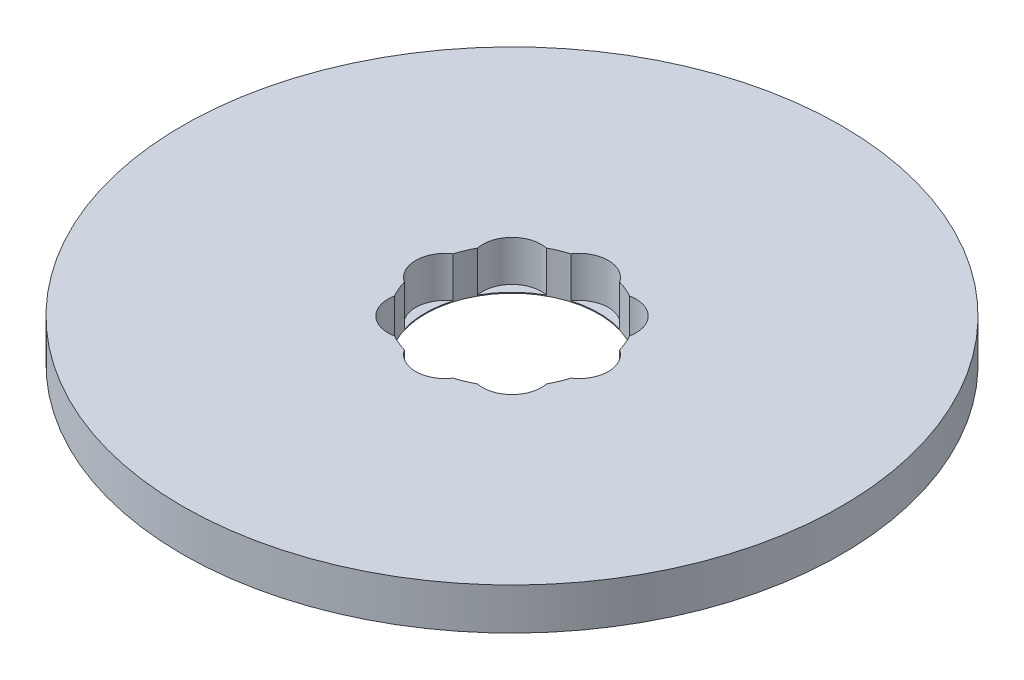
ISO-10303-21;
HEADER;
FILE_DESCRIPTION(('STEP AP214'),'2;1');
FILE_NAME('part.step','',(''),(''),'','','');
FILE_SCHEMA(('AUTOMOTIVE_DESIGN { 1 0 10303 214 1 1 1 1 }'));
ENDSEC;
DATA;
#1=APPLICATION_CONTEXT('core data for automotive mechanical design processes');
#2=APPLICATION_PROTOCOL_DEFINITION('international standard','automotive_design',2000,#1);
#3=PRODUCT_CONTEXT('',#1,'mechanical');
#4=PRODUCT('Part','Part','',(#3));
#5=PRODUCT_RELATED_PRODUCT_CATEGORY('part','',(#4));
#6=PRODUCT_DEFINITION_FORMATION('','',#4);
#7=PRODUCT_DEFINITION_CONTEXT('part definition',#1,'design');
#8=PRODUCT_DEFINITION('design','',#6,#7);
#9=PRODUCT_DEFINITION_SHAPE('','',#8);
#10=(LENGTH_UNIT() NAMED_UNIT(*) SI_UNIT(.MILLI.,.METRE.));
#11=(NAMED_UNIT(*) PLANE_ANGLE_UNIT() SI_UNIT($,.RADIAN.));
#12=(NAMED_UNIT(*) SI_UNIT($,.STERADIAN.) SOLID_ANGLE_UNIT());
#13=UNCERTAINTY_MEASURE_WITH_UNIT(LENGTH_MEASURE(1.E-05),#10,'distance_accuracy_value','');
#14=(GEOMETRIC_REPRESENTATION_CONTEXT(3) GLOBAL_UNCERTAINTY_ASSIGNED_CONTEXT((#13)) GLOBAL_UNIT_ASSIGNED_CONTEXT((#10,
#11,#12)) REPRESENTATION_CONTEXT('',''));
#15=CARTESIAN_POINT('',(0.,0.,0.));
#16=DIRECTION('',(0.,0.,1.));
#17=DIRECTION('',(1.,0.,0.));
#18=AXIS2_PLACEMENT_3D('',#15,#16,#17);
#19=CARTESIAN_POINT('',(0.,12.,0.));
#20=DIRECTION('',(0.,-1.,0.));
#21=DIRECTION('',(0.,0.,-1.));
#22=AXIS2_PLACEMENT_3D('',#19,#20,#21);
#23=CYLINDRICAL_SURFACE('',#22,95.);
#24=CARTESIAN_POINT('',(0.,12.,0.));
#25=DIRECTION('',(0.,1.,0.));
#26=DIRECTION('',(0.,0.,1.));
#27=AXIS2_PLACEMENT_3D('',#24,#25,#26);
#28=CIRCLE('',#27,95.);
#29=CARTESIAN_POINT('',(0.,12.,95.));
#30=VERTEX_POINT('',#29);
#31=EDGE_CURVE('E263',#30,#30,#28,.T.);
#32=ORIENTED_EDGE('',*,*,#31,.F.);
#33=EDGE_LOOP('',(#32));
#34=FACE_BOUND('',#33,.T.);
#35=CARTESIAN_POINT('',(0.,0.,0.));
#36=DIRECTION('',(0.,1.,0.));
#37=DIRECTION('',(0.,0.,1.));
#38=AXIS2_PLACEMENT_3D('',#35,#36,#37);
#39=CIRCLE('',#38,95.);
#40=CARTESIAN_POINT('',(0.,0.,95.));
#41=VERTEX_POINT('',#40);
#42=EDGE_CURVE('E256',#41,#41,#39,.T.);
#43=ORIENTED_EDGE('',*,*,#42,.T.);
#44=EDGE_LOOP('',(#43));
#45=FACE_BOUND('',#44,.T.);
#46=ADVANCED_FACE('F39',(#34,#45),#23,.T.);
#47=CARTESIAN_POINT('',(0.,12.,0.));
#48=DIRECTION('',(0.,1.,0.));
#49=DIRECTION('',(0.,0.,1.));
#50=AXIS2_PLACEMENT_3D('',#47,#48,#49);
#51=PLANE('',#50);
#52=CARTESIAN_POINT('',(-13.6473106291612,12.,13.6473106291613));
#53=DIRECTION('',(0.,1.,0.));
#54=DIRECTION('',(0.707106781186549,0.,0.707106781186546));
#55=AXIS2_PLACEMENT_3D('',#52,#53,#54);
#56=CIRCLE('',#55,8.45747376463113);
#57=CARTESIAN_POINT('',(-21.9398393699623,12.,11.9851344765193));
#58=VERTEX_POINT('',#57);
#59=CARTESIAN_POINT('',(-11.9851344765192,12.,21.9398393699624));
#60=VERTEX_POINT('',#59);
#61=EDGE_CURVE('E246',#58,#60,#56,.T.);
#62=ORIENTED_EDGE('',*,*,#61,.F.);
#63=CARTESIAN_POINT('',(0.,12.,0.));
#64=DIRECTION('',(0.,1.,0.));
#65=DIRECTION('',(0.,0.,1.));
#66=AXIS2_PLACEMENT_3D('',#63,#64,#65);
#67=CIRCLE('',#66,25.);
#68=CARTESIAN_POINT('',(-23.9885790584234,12.,7.03903933486451));
#69=VERTEX_POINT('',#68);
#70=EDGE_CURVE('E254',#69,#58,#67,.T.);
#71=ORIENTED_EDGE('',*,*,#70,.F.);
#72=CARTESIAN_POINT('',(-19.3002117816783,12.,0.));
#73=DIRECTION('',(0.,1.,0.));
#74=DIRECTION('',(0.,0.,1.));
#75=AXIS2_PLACEMENT_3D('',#72,#73,#74);
#76=CIRCLE('',#75,8.45747376463113);
#77=CARTESIAN_POINT('',(-23.9885790584234,12.,-7.03903933486451));
#78=VERTEX_POINT('',#77);
#79=EDGE_CURVE('E248',#78,#69,#76,.T.);
#80=ORIENTED_EDGE('',*,*,#79,.F.);
#81=CARTESIAN_POINT('',(-21.9398393699625,12.,-11.985134476519));
#82=VERTEX_POINT('',#81);
#83=EDGE_CURVE('E257',#82,#78,#67,.T.);
#84=ORIENTED_EDGE('',*,*,#83,.F.);
#85=CARTESIAN_POINT('',(-13.6473106291614,12.,-13.6473106291611));
#86=DIRECTION('',(0.,1.,0.));
#87=DIRECTION('',(-0.707106781186539,0.,0.707106781186556));
#88=AXIS2_PLACEMENT_3D('',#85,#86,#87);
#89=CIRCLE('',#88,8.45747376463113);
#90=CARTESIAN_POINT('',(-11.9851344765195,12.,-21.9398393699622));
#91=VERTEX_POINT('',#90);
#92=EDGE_CURVE('E58',#91,#82,#89,.T.);
#93=ORIENTED_EDGE('',*,*,#92,.F.);
#94=CARTESIAN_POINT('',(-7.03903933486476,12.,-23.9885790584233));
#95=VERTEX_POINT('',#94);
#96=EDGE_CURVE('E168',#95,#91,#67,.T.);
#97=ORIENTED_EDGE('',*,*,#96,.F.);
#98=CARTESIAN_POINT('',(-2.02158987814351E-13,12.,-19.3002117816783));
#99=DIRECTION('',(0.,1.,0.));
#100=DIRECTION('',(-1.,0.,0.));
#101=AXIS2_PLACEMENT_3D('',#98,#99,#100);
#102=CIRCLE('',#101,8.45747376463113);
#103=CARTESIAN_POINT('',(7.03903933486426,12.,-23.9885790584235));
#104=VERTEX_POINT('',#103);
#105=EDGE_CURVE('E165',#104,#95,#102,.T.);
#106=ORIENTED_EDGE('',*,*,#105,.F.);
#107=CARTESIAN_POINT('',(11.9851344765191,12.,-21.9398393699624));
#108=VERTEX_POINT('',#107);
#109=EDGE_CURVE('E604',#108,#104,#67,.T.);
#110=ORIENTED_EDGE('',*,*,#109,.F.);
#111=CARTESIAN_POINT('',(13.6473106291611,12.,-13.6473106291614));
#112=DIRECTION('',(0.,1.,0.));
#113=DIRECTION('',(-0.707106781186554,0.,-0.707106781186541));
#114=AXIS2_PLACEMENT_3D('',#111,#112,#113);
#115=CIRCLE('',#114,8.45747376463113);
#116=CARTESIAN_POINT('',(21.9398393699622,12.,-11.9851344765195));
#117=VERTEX_POINT('',#116);
#118=EDGE_CURVE('E224',#117,#108,#115,.T.);
#119=ORIENTED_EDGE('',*,*,#118,.F.);
#120=CARTESIAN_POINT('',(23.9885790584234,12.,-7.03903933486451));
#121=VERTEX_POINT('',#120);
#122=EDGE_CURVE('E605',#121,#117,#67,.T.);
#123=ORIENTED_EDGE('',*,*,#122,.F.);
#124=CARTESIAN_POINT('',(19.3002117816783,12.,0.));
#125=DIRECTION('',(0.,1.,0.));
#126=DIRECTION('',(0.,0.,-1.));
#127=AXIS2_PLACEMENT_3D('',#124,#125,#126);
#128=CIRCLE('',#127,8.45747376463113);
#129=CARTESIAN_POINT('',(23.9885790584234,12.,7.03903933486451));
#130=VERTEX_POINT('',#129);
#131=EDGE_CURVE('E231',#130,#121,#128,.T.);
#132=ORIENTED_EDGE('',*,*,#131,.F.);
#133=CARTESIAN_POINT('',(21.9398393699624,12.,11.9851344765191));
#134=VERTEX_POINT('',#133);
#135=EDGE_CURVE('E599',#134,#130,#67,.T.);
#136=ORIENTED_EDGE('',*,*,#135,.F.);
#137=CARTESIAN_POINT('',(13.6473106291613,12.,13.6473106291612));
#138=DIRECTION('',(0.,1.,0.));
#139=DIRECTION('',(0.707106781186544,0.,-0.707106781186551));
#140=AXIS2_PLACEMENT_3D('',#137,#138,#139);
#141=CIRCLE('',#140,8.45747376463113);
#142=CARTESIAN_POINT('',(11.9851344765194,12.,21.9398393699623));
#143=VERTEX_POINT('',#142);
#144=EDGE_CURVE('E237',#143,#134,#141,.T.);
#145=ORIENTED_EDGE('',*,*,#144,.F.);
#146=CARTESIAN_POINT('',(7.03903933486459,12.,23.9885790584234));
#147=VERTEX_POINT('',#146);
#148=EDGE_CURVE('E598',#147,#143,#67,.T.);
#149=ORIENTED_EDGE('',*,*,#148,.F.);
#150=CARTESIAN_POINT('',(0.,12.,19.3002117816783));
#151=DIRECTION('',(0.,1.,0.));
#152=DIRECTION('',(1.,0.,0.));
#153=AXIS2_PLACEMENT_3D('',#150,#151,#152);
#154=CIRCLE('',#153,8.45747376463113);
#155=CARTESIAN_POINT('',(-7.03903933486442,12.,23.9885790584234));
#156=VERTEX_POINT('',#155);
#157=EDGE_CURVE('E241',#156,#147,#154,.T.);
#158=ORIENTED_EDGE('',*,*,#157,.F.);
#159=EDGE_CURVE('E259',#60,#156,#67,.T.);
#160=ORIENTED_EDGE('',*,*,#159,.F.);
#161=EDGE_LOOP('',(#62,#71,#80,#84,#93,#97,#106,#110,#119,#123,#132,#136,#145,#149,#158,#160));
#162=FACE_BOUND('',#161,.T.);
#163=ORIENTED_EDGE('',*,*,#31,.T.);
#164=EDGE_LOOP('',(#163));
#165=FACE_BOUND('',#164,.T.);
#166=ADVANCED_FACE('F286',(#162,#165),#51,.T.);
#167=CARTESIAN_POINT('',(0.,0.,0.));
#168=DIRECTION('',(0.,1.,0.));
#169=DIRECTION('',(0.,0.,1.));
#170=AXIS2_PLACEMENT_3D('',#167,#168,#169);
#171=PLANE('',#170);
#172=CARTESIAN_POINT('',(0.,0.,0.));
#173=DIRECTION('',(0.,1.,0.));
#174=DIRECTION('',(0.,0.,1.));
#175=AXIS2_PLACEMENT_3D('',#172,#173,#174);
#176=CIRCLE('',#175,25.);
#177=CARTESIAN_POINT('',(0.,0.,25.));
#178=VERTEX_POINT('',#177);
#179=EDGE_CURVE('E251',#178,#178,#176,.T.);
#180=ORIENTED_EDGE('',*,*,#179,.T.);
#181=EDGE_LOOP('',(#180));
#182=FACE_BOUND('',#181,.T.);
#183=ORIENTED_EDGE('',*,*,#42,.F.);
#184=EDGE_LOOP('',(#183));
#185=FACE_BOUND('',#184,.T.);
#186=ADVANCED_FACE('F308',(#182,#185),#171,.F.);
#187=CARTESIAN_POINT('',(0.,12.,0.));
#188=DIRECTION('',(0.,-1.,0.));
#189=DIRECTION('',(0.,0.,-1.));
#190=AXIS2_PLACEMENT_3D('',#187,#188,#189);
#191=CYLINDRICAL_SURFACE('',#190,25.);
#192=DIRECTION('',(0.,1.,0.));
#193=VECTOR('',#192,1.);
#194=CARTESIAN_POINT('',(-21.9398393699623,6.12585881195569,11.9851344765193));
#195=LINE('',#194,#193);
#196=CARTESIAN_POINT('',(-21.9398393699623,0.251717623911379,11.9851344765193));
#197=VERTEX_POINT('',#196);
#198=EDGE_CURVE('E11',#197,#58,#195,.T.);
#199=ORIENTED_EDGE('',*,*,#198,.F.);
#200=CARTESIAN_POINT('',(0.,0.251717623911379,0.));
#201=DIRECTION('',(0.,1.,0.));
#202=DIRECTION('',(0.,0.,1.));
#203=AXIS2_PLACEMENT_3D('',#200,#201,#202);
#204=CIRCLE('',#203,25.);
#205=CARTESIAN_POINT('',(-11.9851344765192,0.251717623911379,21.9398393699624));
#206=VERTEX_POINT('',#205);
#207=EDGE_CURVE('E157',#197,#206,#204,.T.);
#208=ORIENTED_EDGE('',*,*,#207,.T.);
#209=DIRECTION('',(0.,1.,0.));
#210=VECTOR('',#209,1.);
#211=CARTESIAN_POINT('',(-11.9851344765192,6.12585881195569,21.9398393699624));
#212=LINE('',#211,#210);
#213=EDGE_CURVE('E46',#60,#206,#212,.F.);
#214=ORIENTED_EDGE('',*,*,#213,.F.);
#215=ORIENTED_EDGE('',*,*,#159,.T.);
#216=DIRECTION('',(0.,1.,0.));
#217=VECTOR('',#216,1.);
#218=CARTESIAN_POINT('',(-7.03903933486442,6.12585881195569,23.9885790584234));
#219=LINE('',#218,#217);
#220=CARTESIAN_POINT('',(-7.03903933486442,0.251717623911379,23.9885790584234));
#221=VERTEX_POINT('',#220);
#222=EDGE_CURVE('E198',#221,#156,#219,.T.);
#223=ORIENTED_EDGE('',*,*,#222,.F.);
#224=CARTESIAN_POINT('',(7.03903933486459,0.251717623911379,23.9885790584234));
#225=VERTEX_POINT('',#224);
#226=EDGE_CURVE('E194',#221,#225,#204,.T.);
#227=ORIENTED_EDGE('',*,*,#226,.T.);
#228=DIRECTION('',(0.,1.,0.));
#229=VECTOR('',#228,1.);
#230=CARTESIAN_POINT('',(7.03903933486459,6.12585881195569,23.9885790584234));
#231=LINE('',#230,#229);
#232=EDGE_CURVE('E192',#147,#225,#231,.F.);
#233=ORIENTED_EDGE('',*,*,#232,.F.);
#234=ORIENTED_EDGE('',*,*,#148,.T.);
#235=DIRECTION('',(0.,1.,0.));
#236=VECTOR('',#235,1.);
#237=CARTESIAN_POINT('',(11.9851344765194,6.12585881195569,21.9398393699623));
#238=LINE('',#237,#236);
#239=CARTESIAN_POINT('',(11.9851344765194,0.251717623911379,21.9398393699623));
#240=VERTEX_POINT('',#239);
#241=EDGE_CURVE('E191',#240,#143,#238,.T.);
#242=ORIENTED_EDGE('',*,*,#241,.F.);
#243=CARTESIAN_POINT('',(21.9398393699624,0.251717623911379,11.9851344765191));
#244=VERTEX_POINT('',#243);
#245=EDGE_CURVE('E189',#240,#244,#204,.T.);
#246=ORIENTED_EDGE('',*,*,#245,.T.);
#247=DIRECTION('',(0.,1.,0.));
#248=VECTOR('',#247,1.);
#249=CARTESIAN_POINT('',(21.9398393699624,6.12585881195569,11.9851344765191));
#250=LINE('',#249,#248);
#251=EDGE_CURVE('E187',#134,#244,#250,.F.);
#252=ORIENTED_EDGE('',*,*,#251,.F.);
#253=ORIENTED_EDGE('',*,*,#135,.T.);
#254=DIRECTION('',(0.,1.,0.));
#255=VECTOR('',#254,1.);
#256=CARTESIAN_POINT('',(23.9885790584234,6.12585881195569,7.03903933486451));
#257=LINE('',#256,#255);
#258=CARTESIAN_POINT('',(23.9885790584234,0.251717623911379,7.03903933486451));
#259=VERTEX_POINT('',#258);
#260=EDGE_CURVE('E186',#259,#130,#257,.T.);
#261=ORIENTED_EDGE('',*,*,#260,.F.);
#262=CARTESIAN_POINT('',(23.9885790584234,0.251717623911379,-7.03903933486451));
#263=VERTEX_POINT('',#262);
#264=EDGE_CURVE('E183',#259,#263,#204,.T.);
#265=ORIENTED_EDGE('',*,*,#264,.T.);
#266=DIRECTION('',(0.,1.,0.));
#267=VECTOR('',#266,1.);
#268=CARTESIAN_POINT('',(23.9885790584234,6.12585881195569,-7.03903933486451));
#269=LINE('',#268,#267);
#270=EDGE_CURVE('E181',#121,#263,#269,.F.);
#271=ORIENTED_EDGE('',*,*,#270,.F.);
#272=ORIENTED_EDGE('',*,*,#122,.T.);
#273=DIRECTION('',(0.,1.,0.));
#274=VECTOR('',#273,1.);
#275=CARTESIAN_POINT('',(21.9398393699622,6.12585881195569,-11.9851344765195));
#276=LINE('',#275,#274);
#277=CARTESIAN_POINT('',(21.9398393699622,0.251717623911379,-11.9851344765195));
#278=VERTEX_POINT('',#277);
#279=EDGE_CURVE('E182',#278,#117,#276,.T.);
#280=ORIENTED_EDGE('',*,*,#279,.F.);
#281=CARTESIAN_POINT('',(11.9851344765191,0.251717623911379,-21.9398393699624));
#282=VERTEX_POINT('',#281);
#283=EDGE_CURVE('E179',#278,#282,#204,.T.);
#284=ORIENTED_EDGE('',*,*,#283,.T.);
#285=DIRECTION('',(0.,1.,0.));
#286=VECTOR('',#285,1.);
#287=CARTESIAN_POINT('',(11.9851344765191,6.12585881195569,-21.9398393699624));
#288=LINE('',#287,#286);
#289=EDGE_CURVE('E177',#108,#282,#288,.F.);
#290=ORIENTED_EDGE('',*,*,#289,.F.);
#291=ORIENTED_EDGE('',*,*,#109,.T.);
#292=DIRECTION('',(0.,1.,0.));
#293=VECTOR('',#292,1.);
#294=CARTESIAN_POINT('',(7.03903933486426,6.12585881195569,-23.9885790584235));
#295=LINE('',#294,#293);
#296=CARTESIAN_POINT('',(7.03903933486426,0.251717623911379,-23.9885790584235));
#297=VERTEX_POINT('',#296);
#298=EDGE_CURVE('E176',#297,#104,#295,.T.);
#299=ORIENTED_EDGE('',*,*,#298,.F.);
#300=CARTESIAN_POINT('',(-7.03903933486476,0.251717623911379,-23.9885790584233));
#301=VERTEX_POINT('',#300);
#302=EDGE_CURVE('E159',#297,#301,#204,.T.);
#303=ORIENTED_EDGE('',*,*,#302,.T.);
#304=DIRECTION('',(0.,1.,0.));
#305=VECTOR('',#304,1.);
#306=CARTESIAN_POINT('',(-7.03903933486476,6.12585881195569,-23.9885790584233));
#307=LINE('',#306,#305);
#308=EDGE_CURVE('E171',#95,#301,#307,.F.);
#309=ORIENTED_EDGE('',*,*,#308,.F.);
#310=ORIENTED_EDGE('',*,*,#96,.T.);
#311=DIRECTION('',(0.,1.,0.));
#312=VECTOR('',#311,1.);
#313=CARTESIAN_POINT('',(-11.9851344765195,6.12585881195569,-21.9398393699622));
#314=LINE('',#313,#312);
#315=CARTESIAN_POINT('',(-11.9851344765195,0.251717623911379,-21.9398393699622));
#316=VERTEX_POINT('',#315);
#317=EDGE_CURVE('E156',#316,#91,#314,.T.);
#318=ORIENTED_EDGE('',*,*,#317,.F.);
#319=CARTESIAN_POINT('',(-21.9398393699625,0.251717623911379,-11.985134476519));
#320=VERTEX_POINT('',#319);
#321=EDGE_CURVE('E147',#316,#320,#204,.T.);
#322=ORIENTED_EDGE('',*,*,#321,.T.);
#323=DIRECTION('',(0.,1.,0.));
#324=VECTOR('',#323,1.);
#325=CARTESIAN_POINT('',(-21.9398393699625,6.12585881195569,-11.985134476519));
#326=LINE('',#325,#324);
#327=EDGE_CURVE('E160',#82,#320,#326,.F.);
#328=ORIENTED_EDGE('',*,*,#327,.F.);
#329=ORIENTED_EDGE('',*,*,#83,.T.);
#330=DIRECTION('',(0.,1.,0.));
#331=VECTOR('',#330,1.);
#332=CARTESIAN_POINT('',(-23.9885790584234,6.12585881195569,-7.03903933486451));
#333=LINE('',#332,#331);
#334=CARTESIAN_POINT('',(-23.9885790584234,0.251717623911379,-7.03903933486451));
#335=VERTEX_POINT('',#334);
#336=EDGE_CURVE('E273',#335,#78,#333,.T.);
#337=ORIENTED_EDGE('',*,*,#336,.F.);
#338=CARTESIAN_POINT('',(0.,0.251717623911379,0.));
#339=DIRECTION('',(0.,1.,0.));
#340=DIRECTION('',(0.,0.,1.));
#341=AXIS2_PLACEMENT_3D('',#338,#339,#340);
#342=CIRCLE('',#341,25.);
#343=CARTESIAN_POINT('',(-23.9885790584234,0.251717623911379,7.03903933486451));
#344=VERTEX_POINT('',#343);
#345=EDGE_CURVE('E266',#335,#344,#342,.T.);
#346=ORIENTED_EDGE('',*,*,#345,.T.);
#347=DIRECTION('',(0.,1.,0.));
#348=VECTOR('',#347,1.);
#349=CARTESIAN_POINT('',(-23.9885790584234,6.12585881195569,7.03903933486451));
#350=LINE('',#349,#348);
#351=EDGE_CURVE('E271',#69,#344,#350,.F.);
#352=ORIENTED_EDGE('',*,*,#351,.F.);
#353=ORIENTED_EDGE('',*,*,#70,.T.);
#354=EDGE_LOOP('',(#199,#208,#214,#215,#223,#227,#233,#234,#242,#246,#252,#253,#261,#265,#271,
#272,#280,#284,#290,#291,#299,#303,#309,#310,#318,#322,#328,#329,#337,#346,#352,#353));
#355=FACE_BOUND('',#354,.T.);
#356=ORIENTED_EDGE('',*,*,#179,.F.);
#357=EDGE_LOOP('',(#356));
#358=FACE_BOUND('',#357,.T.);
#359=ADVANCED_FACE('F167',(#355,#358),#191,.F.);
#360=CARTESIAN_POINT('',(-19.3002117816783,0.251717623911379,0.));
#361=DIRECTION('',(0.,1.,0.));
#362=DIRECTION('',(0.,0.,1.));
#363=AXIS2_PLACEMENT_3D('',#360,#361,#362);
#364=CYLINDRICAL_SURFACE('',#363,8.45747376463113);
#365=ORIENTED_EDGE('',*,*,#336,.T.);
#366=ORIENTED_EDGE('',*,*,#79,.T.);
#367=ORIENTED_EDGE('',*,*,#351,.T.);
#368=CARTESIAN_POINT('',(-19.3002117816783,0.251717623911379,0.));
#369=DIRECTION('',(0.,1.,0.));
#370=DIRECTION('',(0.,0.,1.));
#371=AXIS2_PLACEMENT_3D('',#368,#369,#370);
#372=CIRCLE('',#371,8.45747376463113);
#373=EDGE_CURVE('E253',#335,#344,#372,.T.);
#374=ORIENTED_EDGE('',*,*,#373,.F.);
#375=EDGE_LOOP('',(#365,#366,#367,#374));
#376=FACE_BOUND('',#375,.T.);
#377=ADVANCED_FACE('F278',(#376),#364,.F.);
#378=CARTESIAN_POINT('',(-19.3002117816783,0.251717623911379,0.));
#379=DIRECTION('',(0.,1.,0.));
#380=DIRECTION('',(0.,0.,1.));
#381=AXIS2_PLACEMENT_3D('',#378,#379,#380);
#382=PLANE('',#381);
#383=ORIENTED_EDGE('',*,*,#373,.T.);
#384=ORIENTED_EDGE('',*,*,#345,.F.);
#385=EDGE_LOOP('',(#383,#384));
#386=FACE_BOUND('',#385,.T.);
#387=ADVANCED_FACE('F289',(#386),#382,.T.);
#388=CARTESIAN_POINT('',(-13.6473106291614,0.251717623911379,-13.6473106291611));
#389=DIRECTION('',(0.,1.,0.));
#390=DIRECTION('',(0.,0.,1.));
#391=AXIS2_PLACEMENT_3D('',#388,#389,#390);
#392=CYLINDRICAL_SURFACE('',#391,8.45747376463113);
#393=ORIENTED_EDGE('',*,*,#317,.T.);
#394=ORIENTED_EDGE('',*,*,#92,.T.);
#395=ORIENTED_EDGE('',*,*,#327,.T.);
#396=CARTESIAN_POINT('',(-13.6473106291614,0.251717623911379,-13.6473106291611));
#397=DIRECTION('',(0.,1.,0.));
#398=DIRECTION('',(-0.707106781186539,0.,0.707106781186556));
#399=AXIS2_PLACEMENT_3D('',#396,#397,#398);
#400=CIRCLE('',#399,8.45747376463113);
#401=EDGE_CURVE('E153',#316,#320,#400,.T.);
#402=ORIENTED_EDGE('',*,*,#401,.F.);
#403=EDGE_LOOP('',(#393,#394,#395,#402));
#404=FACE_BOUND('',#403,.T.);
#405=ADVANCED_FACE('F161',(#404),#392,.F.);
#406=CARTESIAN_POINT('',(-13.6473106291612,0.251717623911379,13.6473106291613));
#407=DIRECTION('',(0.,1.,0.));
#408=DIRECTION('',(0.707106781186549,0.,0.707106781186546));
#409=AXIS2_PLACEMENT_3D('',#406,#407,#408);
#410=PLANE('',#409);
#411=ORIENTED_EDGE('',*,*,#401,.T.);
#412=ORIENTED_EDGE('',*,*,#321,.F.);
#413=EDGE_LOOP('',(#411,#412));
#414=FACE_BOUND('',#413,.T.);
#415=ADVANCED_FACE('F155',(#414),#410,.T.);
#416=CARTESIAN_POINT('',(-2.02158987814351E-13,0.251717623911379,-19.3002117816783));
#417=DIRECTION('',(0.,1.,0.));
#418=DIRECTION('',(0.,0.,1.));
#419=AXIS2_PLACEMENT_3D('',#416,#417,#418);
#420=CYLINDRICAL_SURFACE('',#419,8.45747376463113);
#421=ORIENTED_EDGE('',*,*,#298,.T.);
#422=ORIENTED_EDGE('',*,*,#105,.T.);
#423=ORIENTED_EDGE('',*,*,#308,.T.);
#424=CARTESIAN_POINT('',(-2.02158987814351E-13,0.251717623911379,-19.3002117816783));
#425=DIRECTION('',(0.,1.,0.));
#426=DIRECTION('',(-1.,0.,0.));
#427=AXIS2_PLACEMENT_3D('',#424,#425,#426);
#428=CIRCLE('',#427,8.45747376463113);
#429=EDGE_CURVE('E218',#297,#301,#428,.T.);
#430=ORIENTED_EDGE('',*,*,#429,.F.);
#431=EDGE_LOOP('',(#421,#422,#423,#430));
#432=FACE_BOUND('',#431,.T.);
#433=ADVANCED_FACE('F222',(#432),#420,.F.);
#434=ORIENTED_EDGE('',*,*,#429,.T.);
#435=ORIENTED_EDGE('',*,*,#302,.F.);
#436=EDGE_LOOP('',(#434,#435));
#437=FACE_BOUND('',#436,.T.);
#438=ADVANCED_FACE('F217',(#437),#410,.T.);
#439=CARTESIAN_POINT('',(13.6473106291611,0.251717623911379,-13.6473106291614));
#440=DIRECTION('',(0.,1.,0.));
#441=DIRECTION('',(0.,0.,1.));
#442=AXIS2_PLACEMENT_3D('',#439,#440,#441);
#443=CYLINDRICAL_SURFACE('',#442,8.45747376463113);
#444=ORIENTED_EDGE('',*,*,#279,.T.);
#445=ORIENTED_EDGE('',*,*,#118,.T.);
#446=ORIENTED_EDGE('',*,*,#289,.T.);
#447=CARTESIAN_POINT('',(13.6473106291611,0.251717623911379,-13.6473106291614));
#448=DIRECTION('',(0.,1.,0.));
#449=DIRECTION('',(-0.707106781186554,0.,-0.707106781186541));
#450=AXIS2_PLACEMENT_3D('',#447,#448,#449);
#451=CIRCLE('',#450,8.45747376463113);
#452=EDGE_CURVE('E223',#278,#282,#451,.T.);
#453=ORIENTED_EDGE('',*,*,#452,.F.);
#454=EDGE_LOOP('',(#444,#445,#446,#453));
#455=FACE_BOUND('',#454,.T.);
#456=ADVANCED_FACE('F355',(#455),#443,.F.);
#457=ORIENTED_EDGE('',*,*,#452,.T.);
#458=ORIENTED_EDGE('',*,*,#283,.F.);
#459=EDGE_LOOP('',(#457,#458));
#460=FACE_BOUND('',#459,.T.);
#461=ADVANCED_FACE('F352',(#460),#410,.T.);
#462=CARTESIAN_POINT('',(19.3002117816783,0.251717623911379,0.));
#463=DIRECTION('',(0.,1.,0.));
#464=DIRECTION('',(0.,0.,1.));
#465=AXIS2_PLACEMENT_3D('',#462,#463,#464);
#466=CYLINDRICAL_SURFACE('',#465,8.45747376463113);
#467=ORIENTED_EDGE('',*,*,#260,.T.);
#468=ORIENTED_EDGE('',*,*,#131,.T.);
#469=ORIENTED_EDGE('',*,*,#270,.T.);
#470=CARTESIAN_POINT('',(19.3002117816783,0.251717623911379,0.));
#471=DIRECTION('',(0.,1.,0.));
#472=DIRECTION('',(0.,0.,-1.));
#473=AXIS2_PLACEMENT_3D('',#470,#471,#472);
#474=CIRCLE('',#473,8.45747376463113);
#475=EDGE_CURVE('E232',#259,#263,#474,.T.);
#476=ORIENTED_EDGE('',*,*,#475,.F.);
#477=EDGE_LOOP('',(#467,#468,#469,#476));
#478=FACE_BOUND('',#477,.T.);
#479=ADVANCED_FACE('F369',(#478),#466,.F.);
#480=ORIENTED_EDGE('',*,*,#475,.T.);
#481=ORIENTED_EDGE('',*,*,#264,.F.);
#482=EDGE_LOOP('',(#480,#481));
#483=FACE_BOUND('',#482,.T.);
#484=ADVANCED_FACE('F371',(#483),#410,.T.);
#485=CARTESIAN_POINT('',(13.6473106291613,0.251717623911379,13.6473106291612));
#486=DIRECTION('',(0.,1.,0.));
#487=DIRECTION('',(0.,0.,1.));
#488=AXIS2_PLACEMENT_3D('',#485,#486,#487);
#489=CYLINDRICAL_SURFACE('',#488,8.45747376463113);
#490=ORIENTED_EDGE('',*,*,#241,.T.);
#491=ORIENTED_EDGE('',*,*,#144,.T.);
#492=ORIENTED_EDGE('',*,*,#251,.T.);
#493=CARTESIAN_POINT('',(13.6473106291613,0.251717623911379,13.6473106291612));
#494=DIRECTION('',(0.,1.,0.));
#495=DIRECTION('',(0.707106781186544,0.,-0.707106781186551));
#496=AXIS2_PLACEMENT_3D('',#493,#494,#495);
#497=CIRCLE('',#496,8.45747376463113);
#498=EDGE_CURVE('E236',#240,#244,#497,.T.);
#499=ORIENTED_EDGE('',*,*,#498,.F.);
#500=EDGE_LOOP('',(#490,#491,#492,#499));
#501=FACE_BOUND('',#500,.T.);
#502=ADVANCED_FACE('F390',(#501),#489,.F.);
#503=ORIENTED_EDGE('',*,*,#498,.T.);
#504=ORIENTED_EDGE('',*,*,#245,.F.);
#505=EDGE_LOOP('',(#503,#504));
#506=FACE_BOUND('',#505,.T.);
#507=ADVANCED_FACE('F386',(#506),#410,.T.);
#508=CARTESIAN_POINT('',(0.,0.251717623911379,19.3002117816783));
#509=DIRECTION('',(0.,1.,0.));
#510=DIRECTION('',(0.,0.,1.));
#511=AXIS2_PLACEMENT_3D('',#508,#509,#510);
#512=CYLINDRICAL_SURFACE('',#511,8.45747376463113);
#513=ORIENTED_EDGE('',*,*,#222,.T.);
#514=ORIENTED_EDGE('',*,*,#157,.T.);
#515=ORIENTED_EDGE('',*,*,#232,.T.);
#516=CARTESIAN_POINT('',(0.,0.251717623911379,19.3002117816783));
#517=DIRECTION('',(0.,1.,0.));
#518=DIRECTION('',(1.,0.,0.));
#519=AXIS2_PLACEMENT_3D('',#516,#517,#518);
#520=CIRCLE('',#519,8.45747376463113);
#521=EDGE_CURVE('E242',#221,#225,#520,.T.);
#522=ORIENTED_EDGE('',*,*,#521,.F.);
#523=EDGE_LOOP('',(#513,#514,#515,#522));
#524=FACE_BOUND('',#523,.T.);
#525=ADVANCED_FACE('F403',(#524),#512,.F.);
#526=ORIENTED_EDGE('',*,*,#521,.T.);
#527=ORIENTED_EDGE('',*,*,#226,.F.);
#528=EDGE_LOOP('',(#526,#527));
#529=FACE_BOUND('',#528,.T.);
#530=ADVANCED_FACE('F410',(#529),#410,.T.);
#531=CARTESIAN_POINT('',(-13.6473106291612,0.251717623911379,13.6473106291613));
#532=DIRECTION('',(0.,1.,0.));
#533=DIRECTION('',(0.707106781186549,0.,0.707106781186546));
#534=AXIS2_PLACEMENT_3D('',#531,#532,#533);
#535=CIRCLE('',#534,8.45747376463113);
#536=EDGE_CURVE('E55',#197,#206,#535,.T.);
#537=ORIENTED_EDGE('',*,*,#536,.T.);
#538=ORIENTED_EDGE('',*,*,#207,.F.);
#539=EDGE_LOOP('',(#537,#538));
#540=FACE_BOUND('',#539,.T.);
#541=ADVANCED_FACE('F340',(#540),#410,.T.);
#542=CARTESIAN_POINT('',(-13.6473106291612,0.251717623911379,13.6473106291613));
#543=DIRECTION('',(0.,1.,0.));
#544=DIRECTION('',(0.,0.,1.));
#545=AXIS2_PLACEMENT_3D('',#542,#543,#544);
#546=CYLINDRICAL_SURFACE('',#545,8.45747376463113);
#547=ORIENTED_EDGE('',*,*,#198,.T.);
#548=ORIENTED_EDGE('',*,*,#61,.T.);
#549=ORIENTED_EDGE('',*,*,#213,.T.);
#550=ORIENTED_EDGE('',*,*,#536,.F.);
#551=EDGE_LOOP('',(#547,#548,#549,#550));
#552=FACE_BOUND('',#551,.T.);
#553=ADVANCED_FACE('F431',(#552),#546,.F.);
#554=CLOSED_SHELL('',(#46,#166,#186,#359,#377,#387,#405,#415,#433,#438,#456,#461,#479,#484,#502,
#507,#525,#530,#541,#553));
#555=MANIFOLD_SOLID_BREP('B2',#554);
#556=ADVANCED_BREP_SHAPE_REPRESENTATION('',(#18,#555),#14);
#557=SHAPE_DEFINITION_REPRESENTATION(#9,#556);
ENDSEC;
END-ISO-10303-21;
